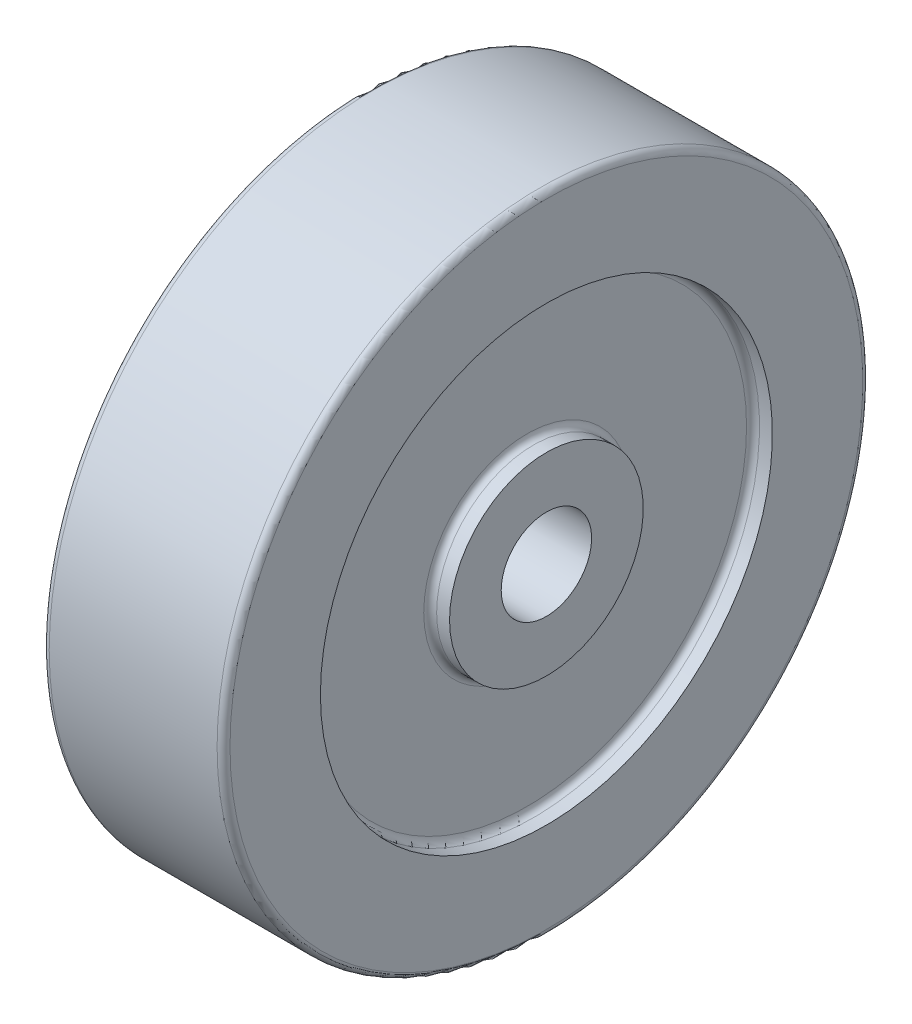
ISO-10303-21;
HEADER;
FILE_DESCRIPTION(('STEP AP214'),'2;1');
FILE_NAME('part.step','',(''),(''),'','','');
FILE_SCHEMA(('AUTOMOTIVE_DESIGN { 1 0 10303 214 1 1 1 1 }'));
ENDSEC;
DATA;
#1=APPLICATION_CONTEXT('core data for automotive mechanical design processes');
#2=APPLICATION_PROTOCOL_DEFINITION('international standard','automotive_design',2000,#1);
#3=PRODUCT_CONTEXT('',#1,'mechanical');
#4=PRODUCT('Part','Part','',(#3));
#5=PRODUCT_RELATED_PRODUCT_CATEGORY('part','',(#4));
#6=PRODUCT_DEFINITION_FORMATION('','',#4);
#7=PRODUCT_DEFINITION_CONTEXT('part definition',#1,'design');
#8=PRODUCT_DEFINITION('design','',#6,#7);
#9=PRODUCT_DEFINITION_SHAPE('','',#8);
#10=(LENGTH_UNIT() NAMED_UNIT(*) SI_UNIT(.MILLI.,.METRE.));
#11=(NAMED_UNIT(*) PLANE_ANGLE_UNIT() SI_UNIT($,.RADIAN.));
#12=(NAMED_UNIT(*) SI_UNIT($,.STERADIAN.) SOLID_ANGLE_UNIT());
#13=UNCERTAINTY_MEASURE_WITH_UNIT(LENGTH_MEASURE(1.E-05),#10,'distance_accuracy_value','');
#14=(GEOMETRIC_REPRESENTATION_CONTEXT(3) GLOBAL_UNCERTAINTY_ASSIGNED_CONTEXT((#13)) GLOBAL_UNIT_ASSIGNED_CONTEXT((#10,
#11,#12)) REPRESENTATION_CONTEXT('',''));
#15=CARTESIAN_POINT('',(0.,0.,0.));
#16=DIRECTION('',(0.,0.,1.));
#17=DIRECTION('',(1.,0.,0.));
#18=AXIS2_PLACEMENT_3D('',#15,#16,#17);
#19=CARTESIAN_POINT('',(0.,0.,0.));
#20=DIRECTION('',(-1.,0.,0.));
#21=DIRECTION('',(0.,0.,1.));
#22=AXIS2_PLACEMENT_3D('',#19,#20,#21);
#23=CYLINDRICAL_SURFACE('',#22,7.);
#24=CARTESIAN_POINT('',(14.,0.,0.));
#25=DIRECTION('',(-1.,0.,0.));
#26=DIRECTION('',(0.,0.,1.));
#27=AXIS2_PLACEMENT_3D('',#24,#25,#26);
#28=CIRCLE('',#27,7.);
#29=CARTESIAN_POINT('',(14.,0.,7.));
#30=VERTEX_POINT('',#29);
#31=EDGE_CURVE('E89',#30,#30,#28,.T.);
#32=ORIENTED_EDGE('',*,*,#31,.F.);
#33=EDGE_LOOP('',(#32));
#34=FACE_BOUND('',#33,.T.);
#35=CARTESIAN_POINT('',(-14.,0.,0.));
#36=DIRECTION('',(-1.,0.,0.));
#37=DIRECTION('',(0.,0.,1.));
#38=AXIS2_PLACEMENT_3D('',#35,#36,#37);
#39=CIRCLE('',#38,7.);
#40=CARTESIAN_POINT('',(-14.,0.,7.));
#41=VERTEX_POINT('',#40);
#42=EDGE_CURVE('E104',#41,#41,#39,.T.);
#43=ORIENTED_EDGE('',*,*,#42,.T.);
#44=EDGE_LOOP('',(#43));
#45=FACE_BOUND('',#44,.T.);
#46=ADVANCED_FACE('F45',(#34,#45),#23,.F.);
#47=CARTESIAN_POINT('',(14.,7.,0.));
#48=DIRECTION('',(-1.,0.,0.));
#49=DIRECTION('',(0.,0.,1.));
#50=AXIS2_PLACEMENT_3D('',#47,#48,#49);
#51=PLANE('',#50);
#52=CARTESIAN_POINT('',(14.,0.,0.));
#53=DIRECTION('',(-1.,0.,0.));
#54=DIRECTION('',(0.,0.,1.));
#55=AXIS2_PLACEMENT_3D('',#52,#53,#54);
#56=CIRCLE('',#55,15.);
#57=CARTESIAN_POINT('',(14.,0.,15.));
#58=VERTEX_POINT('',#57);
#59=EDGE_CURVE('E92',#58,#58,#56,.T.);
#60=ORIENTED_EDGE('',*,*,#59,.F.);
#61=EDGE_LOOP('',(#60));
#62=FACE_BOUND('',#61,.T.);
#63=ORIENTED_EDGE('',*,*,#31,.T.);
#64=EDGE_LOOP('',(#63));
#65=FACE_BOUND('',#64,.T.);
#66=ADVANCED_FACE('F128',(#62,#65),#51,.F.);
#67=CARTESIAN_POINT('',(0.,0.,0.));
#68=DIRECTION('',(-1.,0.,0.));
#69=DIRECTION('',(0.,0.,1.));
#70=AXIS2_PLACEMENT_3D('',#67,#68,#69);
#71=CYLINDRICAL_SURFACE('',#70,15.);
#72=CARTESIAN_POINT('',(12.,0.,0.));
#73=DIRECTION('',(-1.,0.,0.));
#74=DIRECTION('',(0.,0.,1.));
#75=AXIS2_PLACEMENT_3D('',#72,#73,#74);
#76=CIRCLE('',#75,15.);
#77=CARTESIAN_POINT('',(12.,0.,15.));
#78=VERTEX_POINT('',#77);
#79=EDGE_CURVE('E80',#78,#78,#76,.F.);
#80=ORIENTED_EDGE('',*,*,#79,.T.);
#81=EDGE_LOOP('',(#80));
#82=FACE_BOUND('',#81,.T.);
#83=ORIENTED_EDGE('',*,*,#59,.T.);
#84=EDGE_LOOP('',(#83));
#85=FACE_BOUND('',#84,.T.);
#86=ADVANCED_FACE('F134',(#82,#85),#71,.T.);
#87=CARTESIAN_POINT('',(11.,35.,0.));
#88=DIRECTION('',(-1.,0.,0.));
#89=DIRECTION('',(0.,0.,1.));
#90=AXIS2_PLACEMENT_3D('',#87,#88,#89);
#91=PLANE('',#90);
#92=CARTESIAN_POINT('',(11.,0.,0.));
#93=DIRECTION('',(-1.,0.,0.));
#94=DIRECTION('',(0.,0.,1.));
#95=AXIS2_PLACEMENT_3D('',#92,#93,#94);
#96=CIRCLE('',#95,16.);
#97=CARTESIAN_POINT('',(11.,0.,16.));
#98=VERTEX_POINT('',#97);
#99=EDGE_CURVE('E83',#98,#98,#96,.T.);
#100=ORIENTED_EDGE('',*,*,#99,.T.);
#101=EDGE_LOOP('',(#100));
#102=FACE_BOUND('',#101,.T.);
#103=CARTESIAN_POINT('',(11.,0.,0.));
#104=DIRECTION('',(-1.,0.,0.));
#105=DIRECTION('',(0.,0.,1.));
#106=AXIS2_PLACEMENT_3D('',#103,#104,#105);
#107=CIRCLE('',#106,34.);
#108=CARTESIAN_POINT('',(11.,0.,34.));
#109=VERTEX_POINT('',#108);
#110=EDGE_CURVE('E86',#109,#109,#107,.F.);
#111=ORIENTED_EDGE('',*,*,#110,.T.);
#112=EDGE_LOOP('',(#111));
#113=FACE_BOUND('',#112,.T.);
#114=ADVANCED_FACE('F235',(#102,#113),#91,.F.);
#115=CARTESIAN_POINT('',(0.,0.,0.));
#116=DIRECTION('',(-1.,0.,0.));
#117=DIRECTION('',(0.,0.,1.));
#118=AXIS2_PLACEMENT_3D('',#115,#116,#117);
#119=CYLINDRICAL_SURFACE('',#118,35.);
#120=CARTESIAN_POINT('',(12.,0.,0.));
#121=DIRECTION('',(-1.,0.,0.));
#122=DIRECTION('',(0.,0.,1.));
#123=AXIS2_PLACEMENT_3D('',#120,#121,#122);
#124=CIRCLE('',#123,35.);
#125=CARTESIAN_POINT('',(12.,0.,35.));
#126=VERTEX_POINT('',#125);
#127=EDGE_CURVE('E77',#126,#126,#124,.T.);
#128=ORIENTED_EDGE('',*,*,#127,.T.);
#129=EDGE_LOOP('',(#128));
#130=FACE_BOUND('',#129,.T.);
#131=CARTESIAN_POINT('',(14.,0.,0.));
#132=DIRECTION('',(-1.,0.,0.));
#133=DIRECTION('',(0.,0.,1.));
#134=AXIS2_PLACEMENT_3D('',#131,#132,#133);
#135=CIRCLE('',#134,35.);
#136=CARTESIAN_POINT('',(14.,0.,35.));
#137=VERTEX_POINT('',#136);
#138=EDGE_CURVE('E95',#137,#137,#135,.T.);
#139=ORIENTED_EDGE('',*,*,#138,.F.);
#140=EDGE_LOOP('',(#139));
#141=FACE_BOUND('',#140,.T.);
#142=ADVANCED_FACE('F225',(#130,#141),#119,.F.);
#143=CARTESIAN_POINT('',(14.,35.,0.));
#144=DIRECTION('',(-1.,0.,0.));
#145=DIRECTION('',(0.,0.,1.));
#146=AXIS2_PLACEMENT_3D('',#143,#144,#145);
#147=PLANE('',#146);
#148=CARTESIAN_POINT('',(14.,0.,0.));
#149=DIRECTION('',(-1.,0.,0.));
#150=DIRECTION('',(0.,0.,1.));
#151=AXIS2_PLACEMENT_3D('',#148,#149,#150);
#152=CIRCLE('',#151,49.);
#153=CARTESIAN_POINT('',(14.,0.,49.));
#154=VERTEX_POINT('',#153);
#155=EDGE_CURVE('E65',#154,#154,#152,.F.);
#156=ORIENTED_EDGE('',*,*,#155,.T.);
#157=EDGE_LOOP('',(#156));
#158=FACE_BOUND('',#157,.T.);
#159=ORIENTED_EDGE('',*,*,#138,.T.);
#160=EDGE_LOOP('',(#159));
#161=FACE_BOUND('',#160,.T.);
#162=ADVANCED_FACE('F216',(#158,#161),#147,.F.);
#163=CARTESIAN_POINT('',(0.,0.,0.));
#164=DIRECTION('',(-1.,0.,0.));
#165=DIRECTION('',(0.,0.,1.));
#166=AXIS2_PLACEMENT_3D('',#163,#164,#165);
#167=CYLINDRICAL_SURFACE('',#166,50.);
#168=CARTESIAN_POINT('',(-13.,0.,0.));
#169=DIRECTION('',(1.,0.,0.));
#170=DIRECTION('',(0.,0.,-1.));
#171=AXIS2_PLACEMENT_3D('',#168,#169,#170);
#172=CIRCLE('',#171,50.);
#173=CARTESIAN_POINT('',(-13.,0.,-50.));
#174=VERTEX_POINT('',#173);
#175=EDGE_CURVE('E68',#174,#174,#172,.T.);
#176=ORIENTED_EDGE('',*,*,#175,.T.);
#177=EDGE_LOOP('',(#176));
#178=FACE_BOUND('',#177,.T.);
#179=CARTESIAN_POINT('',(13.,0.,0.));
#180=DIRECTION('',(-1.,0.,0.));
#181=DIRECTION('',(0.,0.,1.));
#182=AXIS2_PLACEMENT_3D('',#179,#180,#181);
#183=CIRCLE('',#182,50.);
#184=CARTESIAN_POINT('',(13.,0.,50.));
#185=VERTEX_POINT('',#184);
#186=EDGE_CURVE('E71',#185,#185,#183,.T.);
#187=ORIENTED_EDGE('',*,*,#186,.T.);
#188=EDGE_LOOP('',(#187));
#189=FACE_BOUND('',#188,.T.);
#190=ADVANCED_FACE('F206',(#178,#189),#167,.T.);
#191=CARTESIAN_POINT('',(-14.,35.,0.));
#192=DIRECTION('',(1.,0.,0.));
#193=DIRECTION('',(0.,0.,-1.));
#194=AXIS2_PLACEMENT_3D('',#191,#192,#193);
#195=PLANE('',#194);
#196=CARTESIAN_POINT('',(-14.,0.,0.));
#197=DIRECTION('',(1.,0.,0.));
#198=DIRECTION('',(0.,0.,-1.));
#199=AXIS2_PLACEMENT_3D('',#196,#197,#198);
#200=CIRCLE('',#199,49.);
#201=CARTESIAN_POINT('',(-14.,0.,-49.));
#202=VERTEX_POINT('',#201);
#203=EDGE_CURVE('E74',#202,#202,#200,.F.);
#204=ORIENTED_EDGE('',*,*,#203,.T.);
#205=EDGE_LOOP('',(#204));
#206=FACE_BOUND('',#205,.T.);
#207=CARTESIAN_POINT('',(-14.,0.,0.));
#208=DIRECTION('',(-1.,0.,0.));
#209=DIRECTION('',(0.,0.,1.));
#210=AXIS2_PLACEMENT_3D('',#207,#208,#209);
#211=CIRCLE('',#210,35.);
#212=CARTESIAN_POINT('',(-14.,0.,35.));
#213=VERTEX_POINT('',#212);
#214=EDGE_CURVE('E98',#213,#213,#211,.T.);
#215=ORIENTED_EDGE('',*,*,#214,.F.);
#216=EDGE_LOOP('',(#215));
#217=FACE_BOUND('',#216,.T.);
#218=ADVANCED_FACE('F203',(#206,#217),#195,.F.);
#219=CARTESIAN_POINT('',(0.,0.,0.));
#220=DIRECTION('',(-1.,0.,0.));
#221=DIRECTION('',(0.,0.,1.));
#222=AXIS2_PLACEMENT_3D('',#219,#220,#221);
#223=CYLINDRICAL_SURFACE('',#222,35.);
#224=CARTESIAN_POINT('',(-12.,0.,0.));
#225=DIRECTION('',(1.,0.,0.));
#226=DIRECTION('',(0.,0.,-1.));
#227=AXIS2_PLACEMENT_3D('',#224,#225,#226);
#228=CIRCLE('',#227,35.);
#229=CARTESIAN_POINT('',(-12.,0.,-35.));
#230=VERTEX_POINT('',#229);
#231=EDGE_CURVE('E10',#230,#230,#228,.T.);
#232=ORIENTED_EDGE('',*,*,#231,.T.);
#233=EDGE_LOOP('',(#232));
#234=FACE_BOUND('',#233,.T.);
#235=ORIENTED_EDGE('',*,*,#214,.T.);
#236=EDGE_LOOP('',(#235));
#237=FACE_BOUND('',#236,.T.);
#238=ADVANCED_FACE('F125',(#234,#237),#223,.F.);
#239=CARTESIAN_POINT('',(-11.,35.,0.));
#240=DIRECTION('',(1.,0.,0.));
#241=DIRECTION('',(0.,0.,-1.));
#242=AXIS2_PLACEMENT_3D('',#239,#240,#241);
#243=PLANE('',#242);
#244=CARTESIAN_POINT('',(-11.,0.,0.));
#245=DIRECTION('',(1.,0.,0.));
#246=DIRECTION('',(0.,0.,-1.));
#247=AXIS2_PLACEMENT_3D('',#244,#245,#246);
#248=CIRCLE('',#247,16.);
#249=CARTESIAN_POINT('',(-11.,0.,-16.));
#250=VERTEX_POINT('',#249);
#251=EDGE_CURVE('E52',#250,#250,#248,.T.);
#252=ORIENTED_EDGE('',*,*,#251,.T.);
#253=EDGE_LOOP('',(#252));
#254=FACE_BOUND('',#253,.T.);
#255=CARTESIAN_POINT('',(-11.,0.,0.));
#256=DIRECTION('',(1.,0.,0.));
#257=DIRECTION('',(0.,0.,-1.));
#258=AXIS2_PLACEMENT_3D('',#255,#256,#257);
#259=CIRCLE('',#258,34.);
#260=CARTESIAN_POINT('',(-11.,0.,-34.));
#261=VERTEX_POINT('',#260);
#262=EDGE_CURVE('E56',#261,#261,#259,.F.);
#263=ORIENTED_EDGE('',*,*,#262,.T.);
#264=EDGE_LOOP('',(#263));
#265=FACE_BOUND('',#264,.T.);
#266=ADVANCED_FACE('F118',(#254,#265),#243,.F.);
#267=CARTESIAN_POINT('',(0.,0.,0.));
#268=DIRECTION('',(-1.,0.,0.));
#269=DIRECTION('',(0.,0.,1.));
#270=AXIS2_PLACEMENT_3D('',#267,#268,#269);
#271=CYLINDRICAL_SURFACE('',#270,15.);
#272=CARTESIAN_POINT('',(-12.,0.,0.));
#273=DIRECTION('',(1.,0.,0.));
#274=DIRECTION('',(0.,0.,-1.));
#275=AXIS2_PLACEMENT_3D('',#272,#273,#274);
#276=CIRCLE('',#275,15.);
#277=CARTESIAN_POINT('',(-12.,0.,-15.));
#278=VERTEX_POINT('',#277);
#279=EDGE_CURVE('E60',#278,#278,#276,.F.);
#280=ORIENTED_EDGE('',*,*,#279,.T.);
#281=EDGE_LOOP('',(#280));
#282=FACE_BOUND('',#281,.T.);
#283=CARTESIAN_POINT('',(-14.,0.,0.));
#284=DIRECTION('',(-1.,0.,0.));
#285=DIRECTION('',(0.,0.,1.));
#286=AXIS2_PLACEMENT_3D('',#283,#284,#285);
#287=CIRCLE('',#286,15.);
#288=CARTESIAN_POINT('',(-14.,0.,15.));
#289=VERTEX_POINT('',#288);
#290=EDGE_CURVE('E101',#289,#289,#287,.T.);
#291=ORIENTED_EDGE('',*,*,#290,.F.);
#292=EDGE_LOOP('',(#291));
#293=FACE_BOUND('',#292,.T.);
#294=ADVANCED_FACE('F113',(#282,#293),#271,.T.);
#295=CARTESIAN_POINT('',(-14.,7.,0.));
#296=DIRECTION('',(1.,0.,0.));
#297=DIRECTION('',(0.,0.,-1.));
#298=AXIS2_PLACEMENT_3D('',#295,#296,#297);
#299=PLANE('',#298);
#300=ORIENTED_EDGE('',*,*,#42,.F.);
#301=EDGE_LOOP('',(#300));
#302=FACE_BOUND('',#301,.T.);
#303=ORIENTED_EDGE('',*,*,#290,.T.);
#304=EDGE_LOOP('',(#303));
#305=FACE_BOUND('',#304,.T.);
#306=ADVANCED_FACE('F109',(#302,#305),#299,.F.);
#307=CARTESIAN_POINT('',(12.,0.,0.));
#308=DIRECTION('',(-1.,0.,0.));
#309=DIRECTION('',(0.,0.,1.));
#310=AXIS2_PLACEMENT_3D('',#307,#308,#309);
#311=TOROIDAL_SURFACE('',#310,16.,1.);
#312=ORIENTED_EDGE('',*,*,#79,.F.);
#313=EDGE_LOOP('',(#312));
#314=FACE_BOUND('',#313,.T.);
#315=ORIENTED_EDGE('',*,*,#99,.F.);
#316=EDGE_LOOP('',(#315));
#317=FACE_BOUND('',#316,.T.);
#318=ADVANCED_FACE('F112',(#314,#317),#311,.F.);
#319=CARTESIAN_POINT('',(12.,0.,0.));
#320=DIRECTION('',(-1.,0.,0.));
#321=DIRECTION('',(0.,0.,1.));
#322=AXIS2_PLACEMENT_3D('',#319,#320,#321);
#323=TOROIDAL_SURFACE('',#322,34.,1.);
#324=ORIENTED_EDGE('',*,*,#110,.F.);
#325=EDGE_LOOP('',(#324));
#326=FACE_BOUND('',#325,.T.);
#327=ORIENTED_EDGE('',*,*,#127,.F.);
#328=EDGE_LOOP('',(#327));
#329=FACE_BOUND('',#328,.T.);
#330=ADVANCED_FACE('F142',(#326,#329),#323,.F.);
#331=CARTESIAN_POINT('',(-13.,0.,0.));
#332=DIRECTION('',(1.,0.,0.));
#333=DIRECTION('',(0.,0.,-1.));
#334=AXIS2_PLACEMENT_3D('',#331,#332,#333);
#335=TOROIDAL_SURFACE('',#334,49.,1.);
#336=ORIENTED_EDGE('',*,*,#175,.F.);
#337=EDGE_LOOP('',(#336));
#338=FACE_BOUND('',#337,.T.);
#339=ORIENTED_EDGE('',*,*,#203,.F.);
#340=EDGE_LOOP('',(#339));
#341=FACE_BOUND('',#340,.T.);
#342=ADVANCED_FACE('F146',(#338,#341),#335,.T.);
#343=CARTESIAN_POINT('',(13.,0.,0.));
#344=DIRECTION('',(-1.,0.,0.));
#345=DIRECTION('',(0.,0.,1.));
#346=AXIS2_PLACEMENT_3D('',#343,#344,#345);
#347=TOROIDAL_SURFACE('',#346,49.,1.);
#348=ORIENTED_EDGE('',*,*,#155,.F.);
#349=EDGE_LOOP('',(#348));
#350=FACE_BOUND('',#349,.T.);
#351=ORIENTED_EDGE('',*,*,#186,.F.);
#352=EDGE_LOOP('',(#351));
#353=FACE_BOUND('',#352,.T.);
#354=ADVANCED_FACE('F150',(#350,#353),#347,.T.);
#355=CARTESIAN_POINT('',(-12.,0.,0.));
#356=DIRECTION('',(1.,0.,0.));
#357=DIRECTION('',(0.,0.,-1.));
#358=AXIS2_PLACEMENT_3D('',#355,#356,#357);
#359=TOROIDAL_SURFACE('',#358,16.,1.);
#360=ORIENTED_EDGE('',*,*,#251,.F.);
#361=EDGE_LOOP('',(#360));
#362=FACE_BOUND('',#361,.T.);
#363=ORIENTED_EDGE('',*,*,#279,.F.);
#364=EDGE_LOOP('',(#363));
#365=FACE_BOUND('',#364,.T.);
#366=ADVANCED_FACE('F153',(#362,#365),#359,.F.);
#367=CARTESIAN_POINT('',(-12.,0.,0.));
#368=DIRECTION('',(1.,0.,0.));
#369=DIRECTION('',(0.,0.,-1.));
#370=AXIS2_PLACEMENT_3D('',#367,#368,#369);
#371=TOROIDAL_SURFACE('',#370,34.,1.);
#372=ORIENTED_EDGE('',*,*,#231,.F.);
#373=EDGE_LOOP('',(#372));
#374=FACE_BOUND('',#373,.T.);
#375=ORIENTED_EDGE('',*,*,#262,.F.);
#376=EDGE_LOOP('',(#375));
#377=FACE_BOUND('',#376,.T.);
#378=ADVANCED_FACE('F47',(#374,#377),#371,.F.);
#379=CLOSED_SHELL('',(#46,#66,#86,#114,#142,#162,#190,#218,#238,#266,#294,#306,#318,#330,#342,
#354,#366,#378));
#380=MANIFOLD_SOLID_BREP('B2',#379);
#381=ADVANCED_BREP_SHAPE_REPRESENTATION('',(#18,#380),#14);
#382=SHAPE_DEFINITION_REPRESENTATION(#9,#381);
ENDSEC;
END-ISO-10303-21;
